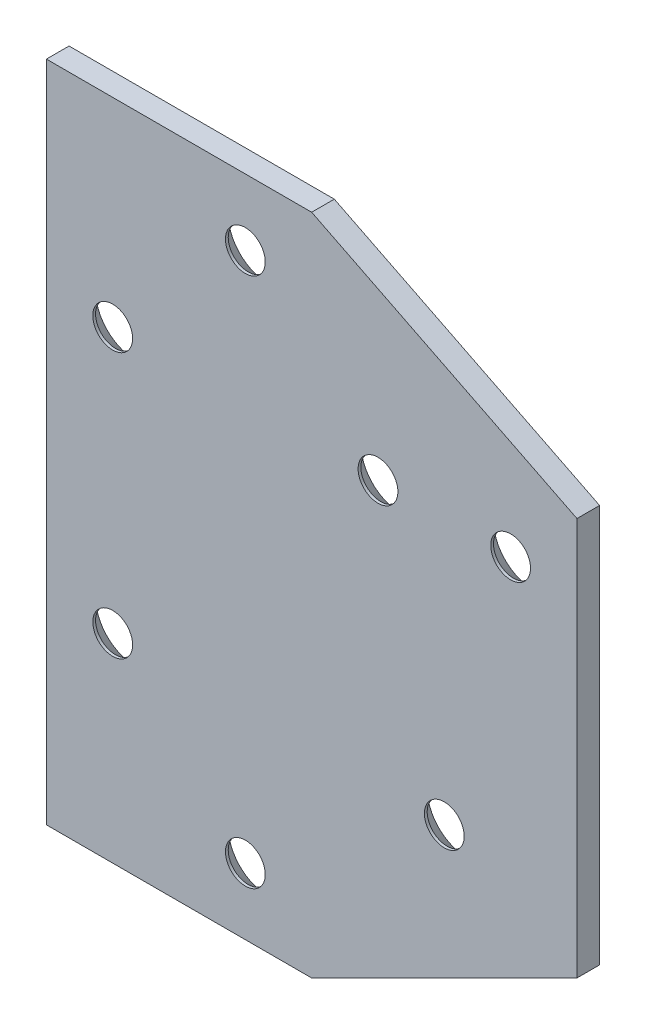
ISO-10303-21;
HEADER;
FILE_DESCRIPTION(('STEP AP214'),'2;1');
FILE_NAME('part.step','',(''),(''),'','','');
FILE_SCHEMA(('AUTOMOTIVE_DESIGN { 1 0 10303 214 1 1 1 1 }'));
ENDSEC;
DATA;
#1=APPLICATION_CONTEXT('core data for automotive mechanical design processes');
#2=APPLICATION_PROTOCOL_DEFINITION('international standard','automotive_design',2000,#1);
#3=PRODUCT_CONTEXT('',#1,'mechanical');
#4=PRODUCT('Part','Part','',(#3));
#5=PRODUCT_RELATED_PRODUCT_CATEGORY('part','',(#4));
#6=PRODUCT_DEFINITION_FORMATION('','',#4);
#7=PRODUCT_DEFINITION_CONTEXT('part definition',#1,'design');
#8=PRODUCT_DEFINITION('design','',#6,#7);
#9=PRODUCT_DEFINITION_SHAPE('','',#8);
#10=(LENGTH_UNIT() NAMED_UNIT(*) SI_UNIT(.MILLI.,.METRE.));
#11=(NAMED_UNIT(*) PLANE_ANGLE_UNIT() SI_UNIT($,.RADIAN.));
#12=(NAMED_UNIT(*) SI_UNIT($,.STERADIAN.) SOLID_ANGLE_UNIT());
#13=UNCERTAINTY_MEASURE_WITH_UNIT(LENGTH_MEASURE(1.E-05),#10,'distance_accuracy_value','');
#14=(GEOMETRIC_REPRESENTATION_CONTEXT(3) GLOBAL_UNCERTAINTY_ASSIGNED_CONTEXT((#13)) GLOBAL_UNIT_ASSIGNED_CONTEXT((#10,
#11,#12)) REPRESENTATION_CONTEXT('',''));
#15=CARTESIAN_POINT('',(0.,0.,0.));
#16=DIRECTION('',(0.,0.,1.));
#17=DIRECTION('',(1.,0.,0.));
#18=AXIS2_PLACEMENT_3D('',#15,#16,#17);
#19=CARTESIAN_POINT('',(-20.,-50.,3.416));
#20=DIRECTION('',(-1.,0.,0.));
#21=DIRECTION('',(0.,0.,1.));
#22=AXIS2_PLACEMENT_3D('',#19,#20,#21);
#23=PLANE('',#22);
#24=DIRECTION('',(0.,1.,0.));
#25=VECTOR('',#24,1.);
#26=CARTESIAN_POINT('',(-20.,-50.,0.));
#27=LINE('',#26,#25);
#28=CARTESIAN_POINT('',(-20.,-50.,0.));
#29=VERTEX_POINT('',#28);
#30=CARTESIAN_POINT('',(-20.,50.,0.));
#31=VERTEX_POINT('',#30);
#32=EDGE_CURVE('E138',#29,#31,#27,.T.);
#33=ORIENTED_EDGE('',*,*,#32,.F.);
#34=DIRECTION('',(0.,0.,-1.));
#35=VECTOR('',#34,1.);
#36=CARTESIAN_POINT('',(-20.,-50.,3.416));
#37=LINE('',#36,#35);
#38=CARTESIAN_POINT('',(-20.,-50.,3.416));
#39=VERTEX_POINT('',#38);
#40=EDGE_CURVE('E64',#39,#29,#37,.T.);
#41=ORIENTED_EDGE('',*,*,#40,.F.);
#42=DIRECTION('',(0.,1.,0.));
#43=VECTOR('',#42,1.);
#44=CARTESIAN_POINT('',(-20.,-50.,3.416));
#45=LINE('',#44,#43);
#46=CARTESIAN_POINT('',(-20.,50.,3.416));
#47=VERTEX_POINT('',#46);
#48=EDGE_CURVE('E159',#39,#47,#45,.T.);
#49=ORIENTED_EDGE('',*,*,#48,.T.);
#50=DIRECTION('',(0.,0.,-1.));
#51=VECTOR('',#50,1.);
#52=CARTESIAN_POINT('',(-20.,50.,3.416));
#53=LINE('',#52,#51);
#54=EDGE_CURVE('E99',#47,#31,#53,.T.);
#55=ORIENTED_EDGE('',*,*,#54,.T.);
#56=EDGE_LOOP('',(#33,#41,#49,#55));
#57=FACE_BOUND('',#56,.T.);
#58=ADVANCED_FACE('F45',(#57),#23,.T.);
#59=CARTESIAN_POINT('',(-20.,-50.,3.416));
#60=DIRECTION('',(0.,1.,0.));
#61=DIRECTION('',(0.,0.,1.));
#62=AXIS2_PLACEMENT_3D('',#59,#60,#61);
#63=PLANE('',#62);
#64=DIRECTION('',(1.,0.,0.));
#65=VECTOR('',#64,1.);
#66=CARTESIAN_POINT('',(-20.,-50.,0.));
#67=LINE('',#66,#65);
#68=CARTESIAN_POINT('',(20.,-50.,0.));
#69=VERTEX_POINT('',#68);
#70=EDGE_CURVE('E156',#29,#69,#67,.T.);
#71=ORIENTED_EDGE('',*,*,#70,.T.);
#72=DIRECTION('',(0.,0.,-1.));
#73=VECTOR('',#72,1.);
#74=CARTESIAN_POINT('',(20.,-50.,3.416));
#75=LINE('',#74,#73);
#76=CARTESIAN_POINT('',(20.,-50.,3.416));
#77=VERTEX_POINT('',#76);
#78=EDGE_CURVE('E88',#77,#69,#75,.T.);
#79=ORIENTED_EDGE('',*,*,#78,.F.);
#80=DIRECTION('',(1.,0.,0.));
#81=VECTOR('',#80,1.);
#82=CARTESIAN_POINT('',(-20.,-50.,3.416));
#83=LINE('',#82,#81);
#84=EDGE_CURVE('E131',#39,#77,#83,.T.);
#85=ORIENTED_EDGE('',*,*,#84,.F.);
#86=ORIENTED_EDGE('',*,*,#40,.T.);
#87=EDGE_LOOP('',(#71,#79,#85,#86));
#88=FACE_BOUND('',#87,.T.);
#89=ADVANCED_FACE('F299',(#88),#63,.F.);
#90=CARTESIAN_POINT('',(60.,-30.,3.416));
#91=DIRECTION('',(0.447213595499958,-0.894427190999916,0.));
#92=DIRECTION('',(0.894427190999916,0.447213595499958,0.));
#93=AXIS2_PLACEMENT_3D('',#90,#91,#92);
#94=PLANE('',#93);
#95=DIRECTION('',(-0.894427190999916,-0.447213595499958,0.));
#96=VECTOR('',#95,1.);
#97=CARTESIAN_POINT('',(60.,-30.,0.));
#98=LINE('',#97,#96);
#99=CARTESIAN_POINT('',(60.,-30.,0.));
#100=VERTEX_POINT('',#99);
#101=EDGE_CURVE('E113',#100,#69,#98,.T.);
#102=ORIENTED_EDGE('',*,*,#101,.F.);
#103=DIRECTION('',(0.,0.,-1.));
#104=VECTOR('',#103,1.);
#105=CARTESIAN_POINT('',(60.,-30.,3.416));
#106=LINE('',#105,#104);
#107=CARTESIAN_POINT('',(60.,-30.,3.416));
#108=VERTEX_POINT('',#107);
#109=EDGE_CURVE('E107',#108,#100,#106,.T.);
#110=ORIENTED_EDGE('',*,*,#109,.F.);
#111=DIRECTION('',(-0.894427190999916,-0.447213595499958,0.));
#112=VECTOR('',#111,1.);
#113=CARTESIAN_POINT('',(60.,-30.,3.416));
#114=LINE('',#113,#112);
#115=EDGE_CURVE('E111',#108,#77,#114,.T.);
#116=ORIENTED_EDGE('',*,*,#115,.T.);
#117=ORIENTED_EDGE('',*,*,#78,.T.);
#118=EDGE_LOOP('',(#102,#110,#116,#117));
#119=FACE_BOUND('',#118,.T.);
#120=ADVANCED_FACE('F109',(#119),#94,.T.);
#121=CARTESIAN_POINT('',(60.,-30.,3.416));
#122=DIRECTION('',(-1.,0.,0.));
#123=DIRECTION('',(0.,0.,1.));
#124=AXIS2_PLACEMENT_3D('',#121,#122,#123);
#125=PLANE('',#124);
#126=DIRECTION('',(0.,1.,0.));
#127=VECTOR('',#126,1.);
#128=CARTESIAN_POINT('',(60.,-30.,0.));
#129=LINE('',#128,#127);
#130=CARTESIAN_POINT('',(60.,30.,0.));
#131=VERTEX_POINT('',#130);
#132=EDGE_CURVE('E151',#100,#131,#129,.T.);
#133=ORIENTED_EDGE('',*,*,#132,.T.);
#134=DIRECTION('',(0.,0.,-1.));
#135=VECTOR('',#134,1.);
#136=CARTESIAN_POINT('',(60.,30.,3.416));
#137=LINE('',#136,#135);
#138=CARTESIAN_POINT('',(60.,30.,3.416));
#139=VERTEX_POINT('',#138);
#140=EDGE_CURVE('E118',#139,#131,#137,.T.);
#141=ORIENTED_EDGE('',*,*,#140,.F.);
#142=DIRECTION('',(0.,1.,0.));
#143=VECTOR('',#142,1.);
#144=CARTESIAN_POINT('',(60.,-30.,3.416));
#145=LINE('',#144,#143);
#146=EDGE_CURVE('E121',#108,#139,#145,.T.);
#147=ORIENTED_EDGE('',*,*,#146,.F.);
#148=ORIENTED_EDGE('',*,*,#109,.T.);
#149=EDGE_LOOP('',(#133,#141,#147,#148));
#150=FACE_BOUND('',#149,.T.);
#151=ADVANCED_FACE('F122',(#150),#125,.F.);
#152=CARTESIAN_POINT('',(20.,50.,3.416));
#153=DIRECTION('',(0.447213595499958,0.894427190999916,0.));
#154=DIRECTION('',(-0.894427190999916,0.447213595499958,0.));
#155=AXIS2_PLACEMENT_3D('',#152,#153,#154);
#156=PLANE('',#155);
#157=DIRECTION('',(0.894427190999916,-0.447213595499958,0.));
#158=VECTOR('',#157,1.);
#159=CARTESIAN_POINT('',(20.,50.,0.));
#160=LINE('',#159,#158);
#161=CARTESIAN_POINT('',(20.,50.,0.));
#162=VERTEX_POINT('',#161);
#163=EDGE_CURVE('E147',#162,#131,#160,.T.);
#164=ORIENTED_EDGE('',*,*,#163,.F.);
#165=DIRECTION('',(0.,0.,-1.));
#166=VECTOR('',#165,1.);
#167=CARTESIAN_POINT('',(20.,50.,3.416));
#168=LINE('',#167,#166);
#169=CARTESIAN_POINT('',(20.,50.,3.416));
#170=VERTEX_POINT('',#169);
#171=EDGE_CURVE('E167',#170,#162,#168,.T.);
#172=ORIENTED_EDGE('',*,*,#171,.F.);
#173=DIRECTION('',(0.894427190999916,-0.447213595499958,0.));
#174=VECTOR('',#173,1.);
#175=CARTESIAN_POINT('',(20.,50.,3.416));
#176=LINE('',#175,#174);
#177=EDGE_CURVE('E127',#170,#139,#176,.T.);
#178=ORIENTED_EDGE('',*,*,#177,.T.);
#179=ORIENTED_EDGE('',*,*,#140,.T.);
#180=EDGE_LOOP('',(#164,#172,#178,#179));
#181=FACE_BOUND('',#180,.T.);
#182=ADVANCED_FACE('F243',(#181),#156,.T.);
#183=CARTESIAN_POINT('',(-20.,50.,3.416));
#184=DIRECTION('',(0.,1.,0.));
#185=DIRECTION('',(0.,0.,1.));
#186=AXIS2_PLACEMENT_3D('',#183,#184,#185);
#187=PLANE('',#186);
#188=DIRECTION('',(1.,0.,0.));
#189=VECTOR('',#188,1.);
#190=CARTESIAN_POINT('',(-20.,50.,0.));
#191=LINE('',#190,#189);
#192=EDGE_CURVE('E142',#31,#162,#191,.T.);
#193=ORIENTED_EDGE('',*,*,#192,.F.);
#194=ORIENTED_EDGE('',*,*,#54,.F.);
#195=DIRECTION('',(1.,0.,0.));
#196=VECTOR('',#195,1.);
#197=CARTESIAN_POINT('',(-20.,50.,3.416));
#198=LINE('',#197,#196);
#199=EDGE_CURVE('E241',#47,#170,#198,.T.);
#200=ORIENTED_EDGE('',*,*,#199,.T.);
#201=ORIENTED_EDGE('',*,*,#171,.T.);
#202=EDGE_LOOP('',(#193,#194,#200,#201));
#203=FACE_BOUND('',#202,.T.);
#204=ADVANCED_FACE('F239',(#203),#187,.T.);
#205=CARTESIAN_POINT('',(0.,0.,3.416));
#206=DIRECTION('',(0.,0.,-1.));
#207=DIRECTION('',(-1.,0.,0.));
#208=AXIS2_PLACEMENT_3D('',#205,#206,#207);
#209=PLANE('',#208);
#210=CARTESIAN_POINT('',(-10.,-20.,3.416));
#211=DIRECTION('',(0.,0.,1.));
#212=DIRECTION('',(-1.,0.,0.));
#213=AXIS2_PLACEMENT_3D('',#210,#211,#212);
#214=CIRCLE('',#213,3.);
#215=CARTESIAN_POINT('',(-13.,-20.,3.416));
#216=VERTEX_POINT('',#215);
#217=EDGE_CURVE('E262',#216,#216,#214,.T.);
#218=ORIENTED_EDGE('',*,*,#217,.F.);
#219=EDGE_LOOP('',(#218));
#220=FACE_BOUND('',#219,.T.);
#221=CARTESIAN_POINT('',(50.,20.,3.416));
#222=DIRECTION('',(0.,0.,1.));
#223=DIRECTION('',(1.,0.,0.));
#224=AXIS2_PLACEMENT_3D('',#221,#222,#223);
#225=CIRCLE('',#224,3.);
#226=CARTESIAN_POINT('',(53.,20.,3.416));
#227=VERTEX_POINT('',#226);
#228=EDGE_CURVE('E258',#227,#227,#225,.T.);
#229=ORIENTED_EDGE('',*,*,#228,.F.);
#230=EDGE_LOOP('',(#229));
#231=FACE_BOUND('',#230,.T.);
#232=CARTESIAN_POINT('',(30.,20.,3.416));
#233=DIRECTION('',(0.,0.,1.));
#234=DIRECTION('',(1.,0.,0.));
#235=AXIS2_PLACEMENT_3D('',#232,#233,#234);
#236=CIRCLE('',#235,3.);
#237=CARTESIAN_POINT('',(33.,20.,3.416));
#238=VERTEX_POINT('',#237);
#239=EDGE_CURVE('E254',#238,#238,#236,.T.);
#240=ORIENTED_EDGE('',*,*,#239,.F.);
#241=EDGE_LOOP('',(#240));
#242=FACE_BOUND('',#241,.T.);
#243=CARTESIAN_POINT('',(9.99999999999999,40.,3.416));
#244=DIRECTION('',(0.,0.,1.));
#245=DIRECTION('',(1.,0.,0.));
#246=AXIS2_PLACEMENT_3D('',#243,#244,#245);
#247=CIRCLE('',#246,3.);
#248=CARTESIAN_POINT('',(13.,40.,3.416));
#249=VERTEX_POINT('',#248);
#250=EDGE_CURVE('E253',#249,#249,#247,.T.);
#251=ORIENTED_EDGE('',*,*,#250,.F.);
#252=EDGE_LOOP('',(#251));
#253=FACE_BOUND('',#252,.T.);
#254=CARTESIAN_POINT('',(9.99999999999999,-40.,3.416));
#255=DIRECTION('',(0.,0.,1.));
#256=DIRECTION('',(-1.,0.,0.));
#257=AXIS2_PLACEMENT_3D('',#254,#255,#256);
#258=CIRCLE('',#257,3.);
#259=CARTESIAN_POINT('',(6.99999999999999,-40.,3.416));
#260=VERTEX_POINT('',#259);
#261=EDGE_CURVE('E266',#260,#260,#258,.T.);
#262=ORIENTED_EDGE('',*,*,#261,.F.);
#263=EDGE_LOOP('',(#262));
#264=FACE_BOUND('',#263,.T.);
#265=CARTESIAN_POINT('',(40.,-20.,3.416));
#266=DIRECTION('',(0.,0.,1.));
#267=DIRECTION('',(1.,0.,0.));
#268=AXIS2_PLACEMENT_3D('',#265,#266,#267);
#269=CIRCLE('',#268,3.);
#270=CARTESIAN_POINT('',(43.,-20.,3.416));
#271=VERTEX_POINT('',#270);
#272=EDGE_CURVE('E270',#271,#271,#269,.T.);
#273=ORIENTED_EDGE('',*,*,#272,.F.);
#274=EDGE_LOOP('',(#273));
#275=FACE_BOUND('',#274,.T.);
#276=CARTESIAN_POINT('',(-10.,20.,3.416));
#277=DIRECTION('',(0.,0.,1.));
#278=DIRECTION('',(1.,0.,0.));
#279=AXIS2_PLACEMENT_3D('',#276,#277,#278);
#280=CIRCLE('',#279,3.);
#281=CARTESIAN_POINT('',(-7.00000000000002,20.,3.416));
#282=VERTEX_POINT('',#281);
#283=EDGE_CURVE('E143',#282,#282,#280,.T.);
#284=ORIENTED_EDGE('',*,*,#283,.F.);
#285=EDGE_LOOP('',(#284));
#286=FACE_BOUND('',#285,.T.);
#287=ORIENTED_EDGE('',*,*,#48,.F.);
#288=ORIENTED_EDGE('',*,*,#84,.T.);
#289=ORIENTED_EDGE('',*,*,#115,.F.);
#290=ORIENTED_EDGE('',*,*,#146,.T.);
#291=ORIENTED_EDGE('',*,*,#177,.F.);
#292=ORIENTED_EDGE('',*,*,#199,.F.);
#293=EDGE_LOOP('',(#287,#288,#289,#290,#291,#292));
#294=FACE_BOUND('',#293,.T.);
#295=ADVANCED_FACE('F130',(#220,#231,#242,#253,#264,#275,#286,#294),#209,.F.);
#296=CARTESIAN_POINT('',(0.,0.,0.));
#297=DIRECTION('',(0.,0.,-1.));
#298=DIRECTION('',(-1.,0.,0.));
#299=AXIS2_PLACEMENT_3D('',#296,#297,#298);
#300=PLANE('',#299);
#301=CARTESIAN_POINT('',(-10.,-20.,0.));
#302=DIRECTION('',(0.,0.,-1.));
#303=DIRECTION('',(-1.,0.,0.));
#304=AXIS2_PLACEMENT_3D('',#301,#302,#303);
#305=CIRCLE('',#304,5.99999999999999);
#306=CARTESIAN_POINT('',(-16.,-20.,0.));
#307=VERTEX_POINT('',#306);
#308=EDGE_CURVE('E195',#307,#307,#305,.F.);
#309=ORIENTED_EDGE('',*,*,#308,.T.);
#310=EDGE_LOOP('',(#309));
#311=FACE_BOUND('',#310,.T.);
#312=CARTESIAN_POINT('',(9.99999999999999,-40.,0.));
#313=DIRECTION('',(0.,0.,-1.));
#314=DIRECTION('',(-1.,0.,0.));
#315=AXIS2_PLACEMENT_3D('',#312,#313,#314);
#316=CIRCLE('',#315,5.99999999999999);
#317=CARTESIAN_POINT('',(4.,-40.,0.));
#318=VERTEX_POINT('',#317);
#319=EDGE_CURVE('E191',#318,#318,#316,.F.);
#320=ORIENTED_EDGE('',*,*,#319,.T.);
#321=EDGE_LOOP('',(#320));
#322=FACE_BOUND('',#321,.T.);
#323=CARTESIAN_POINT('',(40.,-20.,0.));
#324=DIRECTION('',(0.,0.,-1.));
#325=DIRECTION('',(-1.,0.,0.));
#326=AXIS2_PLACEMENT_3D('',#323,#324,#325);
#327=CIRCLE('',#326,6.00000000000002);
#328=CARTESIAN_POINT('',(34.,-20.,0.));
#329=VERTEX_POINT('',#328);
#330=EDGE_CURVE('E187',#329,#329,#327,.F.);
#331=ORIENTED_EDGE('',*,*,#330,.T.);
#332=EDGE_LOOP('',(#331));
#333=FACE_BOUND('',#332,.T.);
#334=CARTESIAN_POINT('',(-10.,20.,0.));
#335=DIRECTION('',(0.,0.,-1.));
#336=DIRECTION('',(-1.,0.,0.));
#337=AXIS2_PLACEMENT_3D('',#334,#335,#336);
#338=CIRCLE('',#337,5.99999999999999);
#339=CARTESIAN_POINT('',(-16.,20.,0.));
#340=VERTEX_POINT('',#339);
#341=EDGE_CURVE('E183',#340,#340,#338,.F.);
#342=ORIENTED_EDGE('',*,*,#341,.T.);
#343=EDGE_LOOP('',(#342));
#344=FACE_BOUND('',#343,.T.);
#345=CARTESIAN_POINT('',(9.99999999999999,40.,0.));
#346=DIRECTION('',(0.,0.,-1.));
#347=DIRECTION('',(-1.,0.,0.));
#348=AXIS2_PLACEMENT_3D('',#345,#346,#347);
#349=CIRCLE('',#348,5.99999999999999);
#350=CARTESIAN_POINT('',(4.,40.,0.));
#351=VERTEX_POINT('',#350);
#352=EDGE_CURVE('E179',#351,#351,#349,.F.);
#353=ORIENTED_EDGE('',*,*,#352,.T.);
#354=EDGE_LOOP('',(#353));
#355=FACE_BOUND('',#354,.T.);
#356=CARTESIAN_POINT('',(30.,20.,0.));
#357=DIRECTION('',(0.,0.,-1.));
#358=DIRECTION('',(-1.,0.,0.));
#359=AXIS2_PLACEMENT_3D('',#356,#357,#358);
#360=CIRCLE('',#359,5.99999999999999);
#361=CARTESIAN_POINT('',(24.,20.,0.));
#362=VERTEX_POINT('',#361);
#363=EDGE_CURVE('E175',#362,#362,#360,.F.);
#364=ORIENTED_EDGE('',*,*,#363,.T.);
#365=EDGE_LOOP('',(#364));
#366=FACE_BOUND('',#365,.T.);
#367=CARTESIAN_POINT('',(50.,20.,0.));
#368=DIRECTION('',(0.,0.,-1.));
#369=DIRECTION('',(-1.,0.,0.));
#370=AXIS2_PLACEMENT_3D('',#367,#368,#369);
#371=CIRCLE('',#370,5.99999999999999);
#372=CARTESIAN_POINT('',(44.,20.,0.));
#373=VERTEX_POINT('',#372);
#374=EDGE_CURVE('E162',#373,#373,#371,.F.);
#375=ORIENTED_EDGE('',*,*,#374,.T.);
#376=EDGE_LOOP('',(#375));
#377=FACE_BOUND('',#376,.T.);
#378=ORIENTED_EDGE('',*,*,#32,.T.);
#379=ORIENTED_EDGE('',*,*,#192,.T.);
#380=ORIENTED_EDGE('',*,*,#163,.T.);
#381=ORIENTED_EDGE('',*,*,#132,.F.);
#382=ORIENTED_EDGE('',*,*,#101,.T.);
#383=ORIENTED_EDGE('',*,*,#70,.F.);
#384=EDGE_LOOP('',(#378,#379,#380,#381,#382,#383));
#385=FACE_BOUND('',#384,.T.);
#386=ADVANCED_FACE('F231',(#311,#322,#333,#344,#355,#366,#377,#385),#300,.T.);
#387=CARTESIAN_POINT('',(-10.,20.,0.));
#388=DIRECTION('',(0.,0.,1.));
#389=DIRECTION('',(1.,0.,0.));
#390=AXIS2_PLACEMENT_3D('',#387,#388,#389);
#391=CYLINDRICAL_SURFACE('',#390,3.);
#392=CARTESIAN_POINT('',(-10.,20.,2.99999999999999));
#393=DIRECTION('',(0.,0.,-1.));
#394=DIRECTION('',(-1.,0.,0.));
#395=AXIS2_PLACEMENT_3D('',#392,#393,#394);
#396=CIRCLE('',#395,3.);
#397=CARTESIAN_POINT('',(-13.,20.,2.99999999999999));
#398=VERTEX_POINT('',#397);
#399=EDGE_CURVE('E211',#398,#398,#396,.T.);
#400=ORIENTED_EDGE('',*,*,#399,.T.);
#401=EDGE_LOOP('',(#400));
#402=FACE_BOUND('',#401,.T.);
#403=ORIENTED_EDGE('',*,*,#283,.T.);
#404=EDGE_LOOP('',(#403));
#405=FACE_BOUND('',#404,.T.);
#406=ADVANCED_FACE('F234',(#402,#405),#391,.F.);
#407=CARTESIAN_POINT('',(40.,-20.,0.));
#408=DIRECTION('',(0.,0.,1.));
#409=DIRECTION('',(1.,0.,0.));
#410=AXIS2_PLACEMENT_3D('',#407,#408,#409);
#411=CYLINDRICAL_SURFACE('',#410,3.);
#412=CARTESIAN_POINT('',(40.,-20.,3.00000000000004));
#413=DIRECTION('',(0.,0.,-1.));
#414=DIRECTION('',(-1.,0.,0.));
#415=AXIS2_PLACEMENT_3D('',#412,#413,#414);
#416=CIRCLE('',#415,3.);
#417=CARTESIAN_POINT('',(37.,-20.,3.00000000000004));
#418=VERTEX_POINT('',#417);
#419=EDGE_CURVE('E207',#418,#418,#416,.T.);
#420=ORIENTED_EDGE('',*,*,#419,.T.);
#421=EDGE_LOOP('',(#420));
#422=FACE_BOUND('',#421,.T.);
#423=ORIENTED_EDGE('',*,*,#272,.T.);
#424=EDGE_LOOP('',(#423));
#425=FACE_BOUND('',#424,.T.);
#426=ADVANCED_FACE('F289',(#422,#425),#411,.F.);
#427=CARTESIAN_POINT('',(9.99999999999999,-40.,0.));
#428=DIRECTION('',(0.,0.,1.));
#429=DIRECTION('',(1.,0.,0.));
#430=AXIS2_PLACEMENT_3D('',#427,#428,#429);
#431=CYLINDRICAL_SURFACE('',#430,3.);
#432=CARTESIAN_POINT('',(9.99999999999999,-40.,2.99999999999999));
#433=DIRECTION('',(0.,0.,-1.));
#434=DIRECTION('',(-1.,0.,0.));
#435=AXIS2_PLACEMENT_3D('',#432,#433,#434);
#436=CIRCLE('',#435,3.);
#437=CARTESIAN_POINT('',(6.99999999999999,-40.,2.99999999999999));
#438=VERTEX_POINT('',#437);
#439=EDGE_CURVE('E203',#438,#438,#436,.T.);
#440=ORIENTED_EDGE('',*,*,#439,.T.);
#441=EDGE_LOOP('',(#440));
#442=FACE_BOUND('',#441,.T.);
#443=ORIENTED_EDGE('',*,*,#261,.T.);
#444=EDGE_LOOP('',(#443));
#445=FACE_BOUND('',#444,.T.);
#446=ADVANCED_FACE('F278',(#442,#445),#431,.F.);
#447=CARTESIAN_POINT('',(9.99999999999999,40.,0.));
#448=DIRECTION('',(0.,0.,1.));
#449=DIRECTION('',(1.,0.,0.));
#450=AXIS2_PLACEMENT_3D('',#447,#448,#449);
#451=CYLINDRICAL_SURFACE('',#450,3.);
#452=CARTESIAN_POINT('',(9.99999999999999,40.,2.99999999999999));
#453=DIRECTION('',(0.,0.,-1.));
#454=DIRECTION('',(-1.,0.,0.));
#455=AXIS2_PLACEMENT_3D('',#452,#453,#454);
#456=CIRCLE('',#455,3.);
#457=CARTESIAN_POINT('',(6.99999999999999,40.,2.99999999999999));
#458=VERTEX_POINT('',#457);
#459=EDGE_CURVE('E215',#458,#458,#456,.T.);
#460=ORIENTED_EDGE('',*,*,#459,.T.);
#461=EDGE_LOOP('',(#460));
#462=FACE_BOUND('',#461,.T.);
#463=ORIENTED_EDGE('',*,*,#250,.T.);
#464=EDGE_LOOP('',(#463));
#465=FACE_BOUND('',#464,.T.);
#466=ADVANCED_FACE('F354',(#462,#465),#451,.F.);
#467=CARTESIAN_POINT('',(30.,20.,0.));
#468=DIRECTION('',(0.,0.,1.));
#469=DIRECTION('',(1.,0.,0.));
#470=AXIS2_PLACEMENT_3D('',#467,#468,#469);
#471=CYLINDRICAL_SURFACE('',#470,3.);
#472=CARTESIAN_POINT('',(30.,20.,3.));
#473=DIRECTION('',(0.,0.,-1.));
#474=DIRECTION('',(-1.,0.,0.));
#475=AXIS2_PLACEMENT_3D('',#472,#473,#474);
#476=CIRCLE('',#475,3.);
#477=CARTESIAN_POINT('',(27.,20.,3.));
#478=VERTEX_POINT('',#477);
#479=EDGE_CURVE('E56',#478,#478,#476,.T.);
#480=ORIENTED_EDGE('',*,*,#479,.T.);
#481=EDGE_LOOP('',(#480));
#482=FACE_BOUND('',#481,.T.);
#483=ORIENTED_EDGE('',*,*,#239,.T.);
#484=EDGE_LOOP('',(#483));
#485=FACE_BOUND('',#484,.T.);
#486=ADVANCED_FACE('F222',(#482,#485),#471,.F.);
#487=CARTESIAN_POINT('',(50.,20.,0.));
#488=DIRECTION('',(0.,0.,1.));
#489=DIRECTION('',(1.,0.,0.));
#490=AXIS2_PLACEMENT_3D('',#487,#488,#489);
#491=CYLINDRICAL_SURFACE('',#490,3.);
#492=CARTESIAN_POINT('',(50.,20.,3.));
#493=DIRECTION('',(0.,0.,-1.));
#494=DIRECTION('',(-1.,0.,0.));
#495=AXIS2_PLACEMENT_3D('',#492,#493,#494);
#496=CIRCLE('',#495,3.);
#497=CARTESIAN_POINT('',(47.,20.,3.));
#498=VERTEX_POINT('',#497);
#499=EDGE_CURVE('E11',#498,#498,#496,.T.);
#500=ORIENTED_EDGE('',*,*,#499,.T.);
#501=EDGE_LOOP('',(#500));
#502=FACE_BOUND('',#501,.T.);
#503=ORIENTED_EDGE('',*,*,#228,.T.);
#504=EDGE_LOOP('',(#503));
#505=FACE_BOUND('',#504,.T.);
#506=ADVANCED_FACE('F364',(#502,#505),#491,.F.);
#507=CARTESIAN_POINT('',(-10.,-20.,0.));
#508=DIRECTION('',(0.,0.,1.));
#509=DIRECTION('',(1.,0.,0.));
#510=AXIS2_PLACEMENT_3D('',#507,#508,#509);
#511=CYLINDRICAL_SURFACE('',#510,3.);
#512=CARTESIAN_POINT('',(-10.,-20.,2.99999999999999));
#513=DIRECTION('',(0.,0.,-1.));
#514=DIRECTION('',(-1.,0.,0.));
#515=AXIS2_PLACEMENT_3D('',#512,#513,#514);
#516=CIRCLE('',#515,3.);
#517=CARTESIAN_POINT('',(-13.,-20.,2.99999999999999));
#518=VERTEX_POINT('',#517);
#519=EDGE_CURVE('E199',#518,#518,#516,.T.);
#520=ORIENTED_EDGE('',*,*,#519,.T.);
#521=EDGE_LOOP('',(#520));
#522=FACE_BOUND('',#521,.T.);
#523=ORIENTED_EDGE('',*,*,#217,.T.);
#524=EDGE_LOOP('',(#523));
#525=FACE_BOUND('',#524,.T.);
#526=ADVANCED_FACE('F316',(#522,#525),#511,.F.);
#527=CARTESIAN_POINT('',(-10.,-20.,0.));
#528=DIRECTION('',(0.,0.,-1.));
#529=DIRECTION('',(-1.,0.,0.));
#530=AXIS2_PLACEMENT_3D('',#527,#528,#529);
#531=CONICAL_SURFACE('',#530,5.99999999999999,0.785398163397448);
#532=ORIENTED_EDGE('',*,*,#519,.F.);
#533=EDGE_LOOP('',(#532));
#534=FACE_BOUND('',#533,.T.);
#535=ORIENTED_EDGE('',*,*,#308,.F.);
#536=EDGE_LOOP('',(#535));
#537=FACE_BOUND('',#536,.T.);
#538=ADVANCED_FACE('F309',(#534,#537),#531,.F.);
#539=CARTESIAN_POINT('',(9.99999999999999,-40.,0.));
#540=DIRECTION('',(0.,0.,-1.));
#541=DIRECTION('',(-1.,0.,0.));
#542=AXIS2_PLACEMENT_3D('',#539,#540,#541);
#543=CONICAL_SURFACE('',#542,5.99999999999999,0.785398163397448);
#544=ORIENTED_EDGE('',*,*,#439,.F.);
#545=EDGE_LOOP('',(#544));
#546=FACE_BOUND('',#545,.T.);
#547=ORIENTED_EDGE('',*,*,#319,.F.);
#548=EDGE_LOOP('',(#547));
#549=FACE_BOUND('',#548,.T.);
#550=ADVANCED_FACE('F315',(#546,#549),#543,.F.);
#551=CARTESIAN_POINT('',(40.,-20.,0.));
#552=DIRECTION('',(0.,0.,-1.));
#553=DIRECTION('',(-1.,0.,0.));
#554=AXIS2_PLACEMENT_3D('',#551,#552,#553);
#555=CONICAL_SURFACE('',#554,6.00000000000002,0.785398163397444);
#556=ORIENTED_EDGE('',*,*,#419,.F.);
#557=EDGE_LOOP('',(#556));
#558=FACE_BOUND('',#557,.T.);
#559=ORIENTED_EDGE('',*,*,#330,.F.);
#560=EDGE_LOOP('',(#559));
#561=FACE_BOUND('',#560,.T.);
#562=ADVANCED_FACE('F323',(#558,#561),#555,.F.);
#563=CARTESIAN_POINT('',(-10.,20.,0.));
#564=DIRECTION('',(0.,0.,-1.));
#565=DIRECTION('',(-1.,0.,0.));
#566=AXIS2_PLACEMENT_3D('',#563,#564,#565);
#567=CONICAL_SURFACE('',#566,5.99999999999999,0.785398163397448);
#568=ORIENTED_EDGE('',*,*,#399,.F.);
#569=EDGE_LOOP('',(#568));
#570=FACE_BOUND('',#569,.T.);
#571=ORIENTED_EDGE('',*,*,#341,.F.);
#572=EDGE_LOOP('',(#571));
#573=FACE_BOUND('',#572,.T.);
#574=ADVANCED_FACE('F330',(#570,#573),#567,.F.);
#575=CARTESIAN_POINT('',(9.99999999999999,40.,0.));
#576=DIRECTION('',(0.,0.,-1.));
#577=DIRECTION('',(-1.,0.,0.));
#578=AXIS2_PLACEMENT_3D('',#575,#576,#577);
#579=CONICAL_SURFACE('',#578,5.99999999999999,0.785398163397448);
#580=ORIENTED_EDGE('',*,*,#459,.F.);
#581=EDGE_LOOP('',(#580));
#582=FACE_BOUND('',#581,.T.);
#583=ORIENTED_EDGE('',*,*,#352,.F.);
#584=EDGE_LOOP('',(#583));
#585=FACE_BOUND('',#584,.T.);
#586=ADVANCED_FACE('F228',(#582,#585),#579,.F.);
#587=CARTESIAN_POINT('',(30.,20.,0.));
#588=DIRECTION('',(0.,0.,-1.));
#589=DIRECTION('',(-1.,0.,0.));
#590=AXIS2_PLACEMENT_3D('',#587,#588,#589);
#591=CONICAL_SURFACE('',#590,5.99999999999999,0.785398163397448);
#592=ORIENTED_EDGE('',*,*,#479,.F.);
#593=EDGE_LOOP('',(#592));
#594=FACE_BOUND('',#593,.T.);
#595=ORIENTED_EDGE('',*,*,#363,.F.);
#596=EDGE_LOOP('',(#595));
#597=FACE_BOUND('',#596,.T.);
#598=ADVANCED_FACE('F225',(#594,#597),#591,.F.);
#599=CARTESIAN_POINT('',(50.,20.,0.));
#600=DIRECTION('',(0.,0.,-1.));
#601=DIRECTION('',(-1.,0.,0.));
#602=AXIS2_PLACEMENT_3D('',#599,#600,#601);
#603=CONICAL_SURFACE('',#602,5.99999999999999,0.785398163397447);
#604=ORIENTED_EDGE('',*,*,#499,.F.);
#605=EDGE_LOOP('',(#604));
#606=FACE_BOUND('',#605,.T.);
#607=ORIENTED_EDGE('',*,*,#374,.F.);
#608=EDGE_LOOP('',(#607));
#609=FACE_BOUND('',#608,.T.);
#610=ADVANCED_FACE('F48',(#606,#609),#603,.F.);
#611=CLOSED_SHELL('',(#58,#89,#120,#151,#182,#204,#295,#386,#406,#426,#446,#466,#486,#506,#526,
#538,#550,#562,#574,#586,#598,#610));
#612=MANIFOLD_SOLID_BREP('B2',#611);
#613=ADVANCED_BREP_SHAPE_REPRESENTATION('',(#18,#612),#14);
#614=SHAPE_DEFINITION_REPRESENTATION(#9,#613);
ENDSEC;
END-ISO-10303-21;
